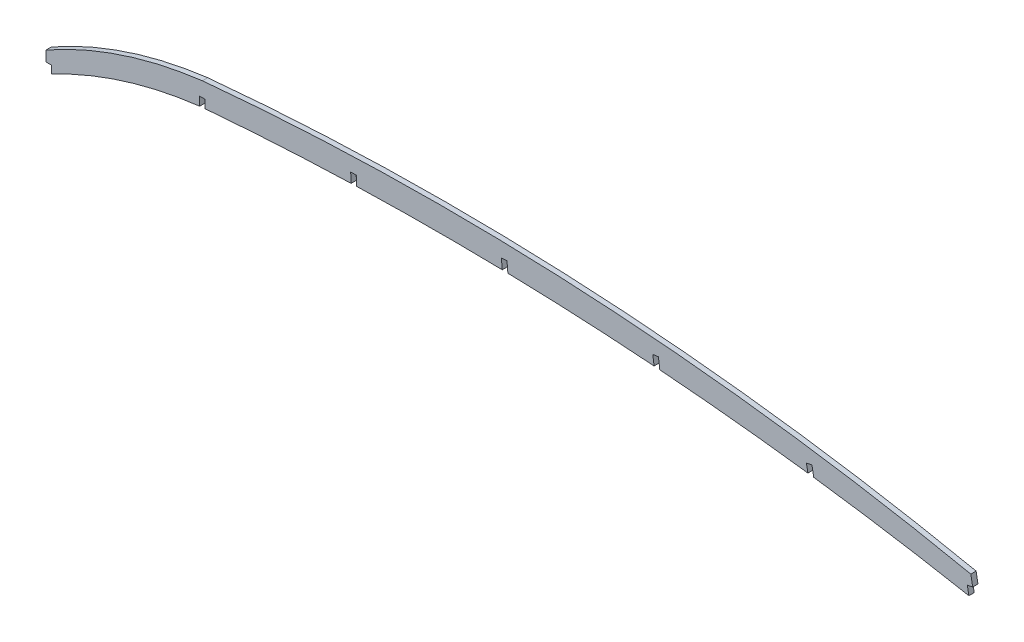
ISO-10303-21;
HEADER;
FILE_DESCRIPTION(('STEP AP214'),'2;1');
FILE_NAME('part.step','',(''),(''),'','','');
FILE_SCHEMA(('AUTOMOTIVE_DESIGN { 1 0 10303 214 1 1 1 1 }'));
ENDSEC;
DATA;
#1=APPLICATION_CONTEXT('core data for automotive mechanical design processes');
#2=APPLICATION_PROTOCOL_DEFINITION('international standard','automotive_design',2000,#1);
#3=PRODUCT_CONTEXT('',#1,'mechanical');
#4=PRODUCT('Part','Part','',(#3));
#5=PRODUCT_RELATED_PRODUCT_CATEGORY('part','',(#4));
#6=PRODUCT_DEFINITION_FORMATION('','',#4);
#7=PRODUCT_DEFINITION_CONTEXT('part definition',#1,'design');
#8=PRODUCT_DEFINITION('design','',#6,#7);
#9=PRODUCT_DEFINITION_SHAPE('','',#8);
#10=(LENGTH_UNIT() NAMED_UNIT(*) SI_UNIT(.MILLI.,.METRE.));
#11=(NAMED_UNIT(*) PLANE_ANGLE_UNIT() SI_UNIT($,.RADIAN.));
#12=(NAMED_UNIT(*) SI_UNIT($,.STERADIAN.) SOLID_ANGLE_UNIT());
#13=UNCERTAINTY_MEASURE_WITH_UNIT(LENGTH_MEASURE(1.E-05),#10,'distance_accuracy_value','');
#14=(GEOMETRIC_REPRESENTATION_CONTEXT(3) GLOBAL_UNCERTAINTY_ASSIGNED_CONTEXT((#13)) GLOBAL_UNIT_ASSIGNED_CONTEXT((#10,
#11,#12)) REPRESENTATION_CONTEXT('',''));
#15=CARTESIAN_POINT('',(0.,0.,0.));
#16=DIRECTION('',(0.,0.,1.));
#17=DIRECTION('',(1.,0.,0.));
#18=AXIS2_PLACEMENT_3D('',#15,#16,#17);
#19=CARTESIAN_POINT('',(7.23067605790107E-13,0.,-3.175));
#20=DIRECTION('',(-1.,0.,0.));
#21=DIRECTION('',(0.,-1.,0.));
#22=AXIS2_PLACEMENT_3D('',#19,#20,#21);
#23=PLANE('',#22);
#24=DIRECTION('',(0.,-1.,0.));
#25=VECTOR('',#24,1.);
#26=CARTESIAN_POINT('',(7.23067605790107E-13,0.,-3.175));
#27=LINE('',#26,#25);
#28=CARTESIAN_POINT('',(0.,106.68,-3.175));
#29=VERTEX_POINT('',#28);
#30=CARTESIAN_POINT('',(0.,100.457,-3.175));
#31=VERTEX_POINT('',#30);
#32=EDGE_CURVE('E280',#29,#31,#27,.T.);
#33=ORIENTED_EDGE('',*,*,#32,.T.);
#34=DIRECTION('',(0.,0.,1.));
#35=VECTOR('',#34,1.);
#36=CARTESIAN_POINT('',(0.,100.457,-3.175));
#37=LINE('',#36,#35);
#38=CARTESIAN_POINT('',(0.,100.457,0.));
#39=VERTEX_POINT('',#38);
#40=EDGE_CURVE('E285',#31,#39,#37,.T.);
#41=ORIENTED_EDGE('',*,*,#40,.T.);
#42=DIRECTION('',(0.,-1.,0.));
#43=VECTOR('',#42,1.);
#44=CARTESIAN_POINT('',(7.23067605790107E-13,0.,0.));
#45=LINE('',#44,#43);
#46=CARTESIAN_POINT('',(0.,106.68,0.));
#47=VERTEX_POINT('',#46);
#48=EDGE_CURVE('E260',#47,#39,#45,.T.);
#49=ORIENTED_EDGE('',*,*,#48,.F.);
#50=DIRECTION('',(0.,0.,1.));
#51=VECTOR('',#50,1.);
#52=CARTESIAN_POINT('',(0.,106.68,-3.175));
#53=LINE('',#52,#51);
#54=EDGE_CURVE('E11',#29,#47,#53,.T.);
#55=ORIENTED_EDGE('',*,*,#54,.F.);
#56=EDGE_LOOP('',(#33,#41,#49,#55));
#57=FACE_BOUND('',#56,.T.);
#58=ADVANCED_FACE('F39',(#57),#23,.T.);
#59=CARTESIAN_POINT('',(557.491562532306,101.659512414379,-3.175));
#60=DIRECTION('',(-0.983777409779827,-0.179393444715503,0.));
#61=DIRECTION('',(0.179393444715503,-0.983777409779827,0.));
#62=AXIS2_PLACEMENT_3D('',#59,#60,#61);
#63=PLANE('',#62);
#64=DIRECTION('',(0.,0.,1.));
#65=VECTOR('',#64,1.);
#66=CARTESIAN_POINT('',(556.764166066413,105.6484887799,-3.175));
#67=LINE('',#66,#65);
#68=CARTESIAN_POINT('',(556.764166066413,105.6484887799,-3.175));
#69=VERTEX_POINT('',#68);
#70=CARTESIAN_POINT('',(556.764166066413,105.6484887799,0.));
#71=VERTEX_POINT('',#70);
#72=EDGE_CURVE('E323',#69,#71,#67,.T.);
#73=ORIENTED_EDGE('',*,*,#72,.F.);
#74=DIRECTION('',(0.179393444715503,-0.983777409779827,0.));
#75=VECTOR('',#74,1.);
#76=CARTESIAN_POINT('',(557.491562532306,101.659512414379,-3.175));
#77=LINE('',#76,#75);
#78=CARTESIAN_POINT('',(555.638244478769,111.822940833397,-3.175));
#79=VERTEX_POINT('',#78);
#80=EDGE_CURVE('E273',#79,#69,#77,.T.);
#81=ORIENTED_EDGE('',*,*,#80,.F.);
#82=DIRECTION('',(0.,0.,1.));
#83=VECTOR('',#82,1.);
#84=CARTESIAN_POINT('',(555.638244478769,111.822940833397,-3.175));
#85=LINE('',#84,#83);
#86=CARTESIAN_POINT('',(555.638244478769,111.822940833397,0.));
#87=VERTEX_POINT('',#86);
#88=EDGE_CURVE('E43',#79,#87,#85,.T.);
#89=ORIENTED_EDGE('',*,*,#88,.T.);
#90=DIRECTION('',(0.179393444715503,-0.983777409779827,0.));
#91=VECTOR('',#90,1.);
#92=CARTESIAN_POINT('',(557.491562532306,101.659512414379,0.));
#93=LINE('',#92,#91);
#94=EDGE_CURVE('E290',#87,#71,#93,.T.);
#95=ORIENTED_EDGE('',*,*,#94,.T.);
#96=EDGE_LOOP('',(#73,#81,#89,#95));
#97=FACE_BOUND('',#96,.T.);
#98=ADVANCED_FACE('F306',(#97),#63,.F.);
#99=CARTESIAN_POINT('',(236.848565858002,-1577.85111526632,-3.175));
#100=DIRECTION('',(0.,0.,1.));
#101=DIRECTION('',(1.,0.,0.));
#102=AXIS2_PLACEMENT_3D('',#99,#100,#101);
#103=CYLINDRICAL_SURFACE('',#102,1707.63280925276);
#104=CARTESIAN_POINT('',(236.848565858002,-1577.85111526632,0.));
#105=DIRECTION('',(0.,0.,1.));
#106=DIRECTION('',(1.,0.,0.));
#107=AXIS2_PLACEMENT_3D('',#104,#105,#106);
#108=CIRCLE('',#107,1707.63280925276);
#109=CARTESIAN_POINT('',(95.6691,123.93564271968,0.));
#110=VERTEX_POINT('',#109);
#111=CARTESIAN_POINT('',(183.294622404811,128.941721130957,0.));
#112=VERTEX_POINT('',#111);
#113=EDGE_CURVE('E289',#110,#112,#108,.F.);
#114=ORIENTED_EDGE('',*,*,#113,.F.);
#115=DIRECTION('',(0.,0.,1.));
#116=VECTOR('',#115,1.);
#117=CARTESIAN_POINT('',(95.6691,123.93564271968,-3.175));
#118=LINE('',#117,#116);
#119=CARTESIAN_POINT('',(95.6691,123.93564271968,-3.175));
#120=VERTEX_POINT('',#119);
#121=EDGE_CURVE('E437',#120,#110,#118,.T.);
#122=ORIENTED_EDGE('',*,*,#121,.F.);
#123=CARTESIAN_POINT('',(236.848565858002,-1577.85111526632,-3.175));
#124=DIRECTION('',(0.,0.,1.));
#125=DIRECTION('',(1.,0.,0.));
#126=AXIS2_PLACEMENT_3D('',#123,#124,#125);
#127=CIRCLE('',#126,1707.63280925276);
#128=CARTESIAN_POINT('',(183.294622404811,128.941721130957,-3.175));
#129=VERTEX_POINT('',#128);
#130=EDGE_CURVE('E265',#120,#129,#127,.F.);
#131=ORIENTED_EDGE('',*,*,#130,.T.);
#132=DIRECTION('',(0.,0.,1.));
#133=VECTOR('',#132,1.);
#134=CARTESIAN_POINT('',(183.294622404811,128.941721130957,-3.175));
#135=LINE('',#134,#133);
#136=EDGE_CURVE('E414',#129,#112,#135,.T.);
#137=ORIENTED_EDGE('',*,*,#136,.T.);
#138=EDGE_LOOP('',(#114,#122,#131,#137));
#139=FACE_BOUND('',#138,.T.);
#140=ADVANCED_FACE('F482',(#139),#103,.F.);
#141=CARTESIAN_POINT('',(186.671482616281,129.044333070749,0.));
#142=VERTEX_POINT('',#141);
#143=CARTESIAN_POINT('',(274.098105392822,129.375373235102,0.));
#144=VERTEX_POINT('',#143);
#145=EDGE_CURVE('E825',#142,#144,#108,.F.);
#146=ORIENTED_EDGE('',*,*,#145,.F.);
#147=DIRECTION('',(0.,0.,1.));
#148=VECTOR('',#147,1.);
#149=CARTESIAN_POINT('',(186.671482616281,129.044333070749,-3.175));
#150=LINE('',#149,#148);
#151=CARTESIAN_POINT('',(186.671482616281,129.044333070749,-3.175));
#152=VERTEX_POINT('',#151);
#153=EDGE_CURVE('E417',#152,#142,#150,.T.);
#154=ORIENTED_EDGE('',*,*,#153,.F.);
#155=CARTESIAN_POINT('',(274.098105392822,129.375373235102,-3.175));
#156=VERTEX_POINT('',#155);
#157=EDGE_CURVE('E808',#152,#156,#127,.F.);
#158=ORIENTED_EDGE('',*,*,#157,.T.);
#159=DIRECTION('',(0.,0.,1.));
#160=VECTOR('',#159,1.);
#161=CARTESIAN_POINT('',(274.098105392822,129.375373235102,-3.175));
#162=LINE('',#161,#160);
#163=EDGE_CURVE('E391',#156,#144,#162,.T.);
#164=ORIENTED_EDGE('',*,*,#163,.T.);
#165=EDGE_LOOP('',(#146,#154,#158,#164));
#166=FACE_BOUND('',#165,.T.);
#167=ADVANCED_FACE('F706',(#166),#103,.F.);
#168=CARTESIAN_POINT('',(277.495469966465,129.29786488241,0.));
#169=VERTEX_POINT('',#168);
#170=CARTESIAN_POINT('',(365.330558587539,124.941352646519,0.));
#171=VERTEX_POINT('',#170);
#172=EDGE_CURVE('E827',#169,#171,#108,.F.);
#173=ORIENTED_EDGE('',*,*,#172,.F.);
#174=DIRECTION('',(0.,0.,1.));
#175=VECTOR('',#174,1.);
#176=CARTESIAN_POINT('',(277.495469966465,129.29786488241,-3.175));
#177=LINE('',#176,#175);
#178=CARTESIAN_POINT('',(277.495469966465,129.29786488241,-3.175));
#179=VERTEX_POINT('',#178);
#180=EDGE_CURVE('E394',#179,#169,#177,.T.);
#181=ORIENTED_EDGE('',*,*,#180,.F.);
#182=CARTESIAN_POINT('',(365.330558587539,124.941352646519,-3.175));
#183=VERTEX_POINT('',#182);
#184=EDGE_CURVE('E806',#179,#183,#127,.F.);
#185=ORIENTED_EDGE('',*,*,#184,.T.);
#186=DIRECTION('',(0.,0.,1.));
#187=VECTOR('',#186,1.);
#188=CARTESIAN_POINT('',(365.330558587539,124.941352646519,-3.175));
#189=LINE('',#188,#187);
#190=EDGE_CURVE('E366',#183,#171,#189,.T.);
#191=ORIENTED_EDGE('',*,*,#190,.T.);
#192=EDGE_LOOP('',(#173,#181,#185,#191));
#193=FACE_BOUND('',#192,.T.);
#194=ADVANCED_FACE('F716',(#193),#103,.F.);
#195=CARTESIAN_POINT('',(368.77346378483,124.678071720924,0.));
#196=VERTEX_POINT('',#195);
#197=CARTESIAN_POINT('',(457.732770478867,115.435623412472,0.));
#198=VERTEX_POINT('',#197);
#199=EDGE_CURVE('E288',#196,#198,#108,.F.);
#200=ORIENTED_EDGE('',*,*,#199,.F.);
#201=DIRECTION('',(0.,0.,1.));
#202=VECTOR('',#201,1.);
#203=CARTESIAN_POINT('',(368.77346378483,124.678071720924,-3.175));
#204=LINE('',#203,#202);
#205=CARTESIAN_POINT('',(368.77346378483,124.678071720924,-3.175));
#206=VERTEX_POINT('',#205);
#207=EDGE_CURVE('E369',#206,#196,#204,.T.);
#208=ORIENTED_EDGE('',*,*,#207,.F.);
#209=CARTESIAN_POINT('',(457.732770478867,115.435623412472,-3.175));
#210=VERTEX_POINT('',#209);
#211=EDGE_CURVE('E263',#206,#210,#127,.F.);
#212=ORIENTED_EDGE('',*,*,#211,.T.);
#213=DIRECTION('',(0.,0.,1.));
#214=VECTOR('',#213,1.);
#215=CARTESIAN_POINT('',(457.732770478867,115.435623412472,-3.175));
#216=LINE('',#215,#214);
#217=EDGE_CURVE('E341',#210,#198,#216,.T.);
#218=ORIENTED_EDGE('',*,*,#217,.T.);
#219=EDGE_LOOP('',(#200,#208,#212,#218));
#220=FACE_BOUND('',#219,.T.);
#221=ADVANCED_FACE('F726',(#220),#103,.F.);
#222=CARTESIAN_POINT('',(461.251045548048,114.972956616346,0.));
#223=VERTEX_POINT('',#222);
#224=CARTESIAN_POINT('',(554.466577904352,99.9833848141185,0.));
#225=VERTEX_POINT('',#224);
#226=EDGE_CURVE('E284',#223,#225,#108,.F.);
#227=ORIENTED_EDGE('',*,*,#226,.F.);
#228=DIRECTION('',(0.,0.,1.));
#229=VECTOR('',#228,1.);
#230=CARTESIAN_POINT('',(461.251045548048,114.972956616346,-3.175));
#231=LINE('',#230,#229);
#232=CARTESIAN_POINT('',(461.251045548048,114.972956616346,-3.175));
#233=VERTEX_POINT('',#232);
#234=EDGE_CURVE('E344',#233,#223,#231,.T.);
#235=ORIENTED_EDGE('',*,*,#234,.F.);
#236=CARTESIAN_POINT('',(554.466577904352,99.9833848141185,-3.175));
#237=VERTEX_POINT('',#236);
#238=EDGE_CURVE('E259',#233,#237,#127,.F.);
#239=ORIENTED_EDGE('',*,*,#238,.T.);
#240=DIRECTION('',(0.,0.,1.));
#241=VECTOR('',#240,1.);
#242=CARTESIAN_POINT('',(554.466577904352,99.9833848141185,-3.175));
#243=LINE('',#242,#241);
#244=EDGE_CURVE('E325',#237,#225,#243,.T.);
#245=ORIENTED_EDGE('',*,*,#244,.T.);
#246=EDGE_LOOP('',(#227,#235,#239,#245));
#247=FACE_BOUND('',#246,.T.);
#248=ADVANCED_FACE('F487',(#247),#103,.F.);
#249=CARTESIAN_POINT('',(0.,0.,-3.175));
#250=DIRECTION('',(0.,0.,1.));
#251=DIRECTION('',(1.,0.,0.));
#252=AXIS2_PLACEMENT_3D('',#249,#250,#251);
#253=PLANE('',#252);
#254=DIRECTION('',(1.,0.,0.));
#255=VECTOR('',#254,1.);
#256=CARTESIAN_POINT('',(0.,100.457,-3.175));
#257=LINE('',#256,#255);
#258=CARTESIAN_POINT('',(3.3528,100.457,-3.175));
#259=VERTEX_POINT('',#258);
#260=EDGE_CURVE('E243',#31,#259,#257,.T.);
#261=ORIENTED_EDGE('',*,*,#260,.F.);
#262=ORIENTED_EDGE('',*,*,#32,.F.);
#263=CARTESIAN_POINT('',(125.005388450822,-114.430046941018,-3.175));
#264=DIRECTION('',(0.,0.,1.));
#265=DIRECTION('',(1.,0.,0.));
#266=AXIS2_PLACEMENT_3D('',#263,#264,#265);
#267=CIRCLE('',#266,254.);
#268=CARTESIAN_POINT('',(93.9799999999999,137.668,-3.175));
#269=VERTEX_POINT('',#268);
#270=EDGE_CURVE('E278',#29,#269,#267,.F.);
#271=ORIENTED_EDGE('',*,*,#270,.T.);
#272=CARTESIAN_POINT('',(239.516480687623,-1398.7972273158,-3.175));
#273=DIRECTION('',(0.,0.,1.));
#274=DIRECTION('',(1.,0.,0.));
#275=AXIS2_PLACEMENT_3D('',#272,#273,#274);
#276=CIRCLE('',#275,1543.34256144303);
#277=EDGE_CURVE('E276',#269,#79,#276,.F.);
#278=ORIENTED_EDGE('',*,*,#277,.T.);
#279=ORIENTED_EDGE('',*,*,#80,.T.);
#280=DIRECTION('',(0.983777385928307,0.179393575515032,0.));
#281=VECTOR('',#280,1.);
#282=CARTESIAN_POINT('',(-0.727383479957661,3.98890214672276,-3.175));
#283=LINE('',#282,#281);
#284=CARTESIAN_POINT('',(553.540722527769,105.060688053699,-3.175));
#285=VERTEX_POINT('',#284);
#286=EDGE_CURVE('E317',#285,#69,#283,.T.);
#287=ORIENTED_EDGE('',*,*,#286,.F.);
#288=DIRECTION('',(0.179393575515035,-0.983777385928306,0.));
#289=VECTOR('',#288,1.);
#290=CARTESIAN_POINT('',(554.268106007726,101.071785906978,-3.175));
#291=LINE('',#290,#289);
#292=EDGE_CURVE('E320',#285,#237,#291,.T.);
#293=ORIENTED_EDGE('',*,*,#292,.T.);
#294=ORIENTED_EDGE('',*,*,#238,.F.);
#295=DIRECTION('',(0.179393575249242,-0.983777385976774,0.));
#296=VECTOR('',#295,1.);
#297=CARTESIAN_POINT('',(466.697850787917,85.1031922540635,-3.175));
#298=LINE('',#297,#296);
#299=CARTESIAN_POINT('',(460.178373044082,120.855391093135,-3.175));
#300=VERTEX_POINT('',#299);
#301=EDGE_CURVE('E349',#300,#233,#298,.T.);
#302=ORIENTED_EDGE('',*,*,#301,.F.);
#303=DIRECTION('',(0.983777385976774,0.17939357524924,0.));
#304=VECTOR('',#303,1.);
#305=CARTESIAN_POINT('',(-6.51947774383423,35.7521988390729,-3.175));
#306=LINE('',#305,#304);
#307=CARTESIAN_POINT('',(456.854976278776,120.249363717228,-3.175));
#308=VERTEX_POINT('',#307);
#309=EDGE_CURVE('E357',#308,#300,#306,.T.);
#310=ORIENTED_EDGE('',*,*,#309,.F.);
#311=DIRECTION('',(0.179393575249242,-0.983777385976774,0.));
#312=VECTOR('',#311,1.);
#313=CARTESIAN_POINT('',(463.37445402261,84.4971648781566,-3.175));
#314=LINE('',#313,#312);
#315=EDGE_CURVE('E339',#308,#210,#314,.T.);
#316=ORIENTED_EDGE('',*,*,#315,.T.);
#317=ORIENTED_EDGE('',*,*,#211,.F.);
#318=DIRECTION('',(0.131758387385287,-0.991281860700391,0.));
#319=VECTOR('',#318,1.);
#320=CARTESIAN_POINT('',(378.655621379288,50.329836573483,-3.175));
#321=LINE('',#320,#319);
#322=CARTESIAN_POINT('',(367.926681812887,131.048820675984,-3.175));
#323=VERTEX_POINT('',#322);
#324=EDGE_CURVE('E374',#323,#206,#321,.T.);
#325=ORIENTED_EDGE('',*,*,#324,.F.);
#326=DIRECTION('',(0.99128186070039,0.131758387385291,0.));
#327=VECTOR('',#326,1.);
#328=CARTESIAN_POINT('',(-10.7289395664012,80.7189841024994,-3.175));
#329=LINE('',#328,#327);
#330=CARTESIAN_POINT('',(364.577933431069,130.603714491719,-3.175));
#331=VERTEX_POINT('',#330);
#332=EDGE_CURVE('E382',#331,#323,#329,.T.);
#333=ORIENTED_EDGE('',*,*,#332,.F.);
#334=DIRECTION('',(0.131758387385292,-0.99128186070039,0.));
#335=VECTOR('',#334,1.);
#336=CARTESIAN_POINT('',(375.30687299747,49.8847303892201,-3.175));
#337=LINE('',#336,#335);
#338=EDGE_CURVE('E364',#331,#183,#337,.T.);
#339=ORIENTED_EDGE('',*,*,#338,.T.);
#340=ORIENTED_EDGE('',*,*,#184,.F.);
#341=DIRECTION('',(0.0857626231153062,-0.996315598832208,0.));
#342=VECTOR('',#341,1.);
#343=CARTESIAN_POINT('',(286.502495658872,24.6620705182039,-3.175));
#344=LINE('',#343,#342);
#345=CARTESIAN_POINT('',(276.956583497475,135.558179405811,-3.175));
#346=VERTEX_POINT('',#345);
#347=EDGE_CURVE('E398',#346,#179,#344,.T.);
#348=ORIENTED_EDGE('',*,*,#347,.F.);
#349=DIRECTION('',(0.996315598832208,0.0857626231153069,0.));
#350=VECTOR('',#349,1.);
#351=CARTESIAN_POINT('',(-9.54591216139695,110.896108887607,-3.175));
#352=LINE('',#351,#350);
#353=CARTESIAN_POINT('',(273.5908301415,135.268456112403,-3.175));
#354=VERTEX_POINT('',#353);
#355=EDGE_CURVE('E406',#354,#346,#352,.T.);
#356=ORIENTED_EDGE('',*,*,#355,.F.);
#357=DIRECTION('',(0.0857626231153062,-0.996315598832208,0.));
#358=VECTOR('',#357,1.);
#359=CARTESIAN_POINT('',(283.136742302897,24.3723472247958,-3.175));
#360=LINE('',#359,#358);
#361=EDGE_CURVE('E389',#354,#156,#360,.T.);
#362=ORIENTED_EDGE('',*,*,#361,.T.);
#363=ORIENTED_EDGE('',*,*,#157,.F.);
#364=DIRECTION('',(0.0417483675024306,-0.999128156850202,0.));
#365=VECTOR('',#364,1.);
#366=CARTESIAN_POINT('',(191.728821282335,8.01134993226182,-3.175));
#367=LINE('',#366,#365);
#368=CARTESIAN_POINT('',(186.429805754916,134.828179757341,-3.175));
#369=VERTEX_POINT('',#368);
#370=EDGE_CURVE('E421',#369,#152,#367,.T.);
#371=ORIENTED_EDGE('',*,*,#370,.F.);
#372=DIRECTION('',(0.999128156850202,0.0417483675024315,0.));
#373=VECTOR('',#372,1.);
#374=CARTESIAN_POINT('',(-5.29901552741899,126.816829825079,-3.175));
#375=LINE('',#374,#373);
#376=CARTESIAN_POINT('',(183.054551015444,134.687145422245,-3.175));
#377=VERTEX_POINT('',#376);
#378=EDGE_CURVE('E428',#377,#369,#375,.T.);
#379=ORIENTED_EDGE('',*,*,#378,.F.);
#380=DIRECTION('',(0.0417483675024306,-0.999128156850202,0.));
#381=VECTOR('',#380,1.);
#382=CARTESIAN_POINT('',(188.353566542863,7.87031559716512,-3.175));
#383=LINE('',#382,#381);
#384=EDGE_CURVE('E412',#377,#129,#383,.T.);
#385=ORIENTED_EDGE('',*,*,#384,.T.);
#386=ORIENTED_EDGE('',*,*,#130,.F.);
#387=DIRECTION('',(0.,-1.,0.));
#388=VECTOR('',#387,1.);
#389=CARTESIAN_POINT('',(95.6691,0.,-3.175));
#390=LINE('',#389,#388);
#391=CARTESIAN_POINT('',(95.6691,128.848746883729,-3.175));
#392=VERTEX_POINT('',#391);
#393=EDGE_CURVE('E442',#392,#120,#390,.T.);
#394=ORIENTED_EDGE('',*,*,#393,.F.);
#395=DIRECTION('',(1.,0.,0.));
#396=VECTOR('',#395,1.);
#397=CARTESIAN_POINT('',(0.,128.848746883729,-3.175));
#398=LINE('',#397,#396);
#399=CARTESIAN_POINT('',(92.2909,128.848746883729,-3.175));
#400=VERTEX_POINT('',#399);
#401=EDGE_CURVE('E448',#400,#392,#398,.T.);
#402=ORIENTED_EDGE('',*,*,#401,.F.);
#403=DIRECTION('',(0.,-1.,0.));
#404=VECTOR('',#403,1.);
#405=CARTESIAN_POINT('',(92.2909,0.,-3.175));
#406=LINE('',#405,#404);
#407=CARTESIAN_POINT('',(92.2909,123.599182896413,-3.175));
#408=VERTEX_POINT('',#407);
#409=EDGE_CURVE('E258',#400,#408,#406,.T.);
#410=ORIENTED_EDGE('',*,*,#409,.T.);
#411=CARTESIAN_POINT('',(122.337166720402,-128.617434034682,-3.175));
#412=DIRECTION('',(0.,0.,1.));
#413=DIRECTION('',(1.,0.,0.));
#414=AXIS2_PLACEMENT_3D('',#411,#412,#413);
#415=CIRCLE('',#414,254.);
#416=CARTESIAN_POINT('',(3.35279999999999,95.790053532344,-3.175));
#417=VERTEX_POINT('',#416);
#418=EDGE_CURVE('E250',#417,#408,#415,.F.);
#419=ORIENTED_EDGE('',*,*,#418,.F.);
#420=DIRECTION('',(0.,1.,0.));
#421=VECTOR('',#420,1.);
#422=CARTESIAN_POINT('',(3.35279999999999,0.,-3.175));
#423=LINE('',#422,#421);
#424=EDGE_CURVE('E233',#417,#259,#423,.T.);
#425=ORIENTED_EDGE('',*,*,#424,.T.);
#426=EDGE_LOOP('',(#261,#262,#271,#278,#279,#287,#293,#294,#302,#310,#316,#317,#325,#333,#339,
#340,#348,#356,#362,#363,#371,#379,#385,#386,#394,#402,#410,#419,#425));
#427=FACE_BOUND('',#426,.T.);
#428=ADVANCED_FACE('F255',(#427),#253,.F.);
#429=CARTESIAN_POINT('',(0.,0.,0.));
#430=DIRECTION('',(0.,0.,1.));
#431=DIRECTION('',(1.,0.,0.));
#432=AXIS2_PLACEMENT_3D('',#429,#430,#431);
#433=PLANE('',#432);
#434=ORIENTED_EDGE('',*,*,#48,.T.);
#435=DIRECTION('',(1.,0.,0.));
#436=VECTOR('',#435,1.);
#437=CARTESIAN_POINT('',(0.,100.457,0.));
#438=LINE('',#437,#436);
#439=CARTESIAN_POINT('',(3.3528,100.457,0.));
#440=VERTEX_POINT('',#439);
#441=EDGE_CURVE('E244',#39,#440,#438,.T.);
#442=ORIENTED_EDGE('',*,*,#441,.T.);
#443=DIRECTION('',(0.,1.,0.));
#444=VECTOR('',#443,1.);
#445=CARTESIAN_POINT('',(3.35279999999999,0.,0.));
#446=LINE('',#445,#444);
#447=CARTESIAN_POINT('',(3.35279999999999,95.790053532344,0.));
#448=VERTEX_POINT('',#447);
#449=EDGE_CURVE('E439',#448,#440,#446,.T.);
#450=ORIENTED_EDGE('',*,*,#449,.F.);
#451=CARTESIAN_POINT('',(122.337166720402,-128.617434034682,0.));
#452=DIRECTION('',(0.,0.,1.));
#453=DIRECTION('',(1.,0.,0.));
#454=AXIS2_PLACEMENT_3D('',#451,#452,#453);
#455=CIRCLE('',#454,254.);
#456=CARTESIAN_POINT('',(92.2909,123.599182896413,0.));
#457=VERTEX_POINT('',#456);
#458=EDGE_CURVE('E252',#448,#457,#455,.F.);
#459=ORIENTED_EDGE('',*,*,#458,.T.);
#460=DIRECTION('',(0.,-1.,0.));
#461=VECTOR('',#460,1.);
#462=CARTESIAN_POINT('',(92.2909,0.,0.));
#463=LINE('',#462,#461);
#464=CARTESIAN_POINT('',(92.2909,128.848746883729,0.));
#465=VERTEX_POINT('',#464);
#466=EDGE_CURVE('E440',#465,#457,#463,.T.);
#467=ORIENTED_EDGE('',*,*,#466,.F.);
#468=DIRECTION('',(1.,0.,0.));
#469=VECTOR('',#468,1.);
#470=CARTESIAN_POINT('',(0.,128.848746883729,0.));
#471=LINE('',#470,#469);
#472=CARTESIAN_POINT('',(95.6691,128.848746883729,0.));
#473=VERTEX_POINT('',#472);
#474=EDGE_CURVE('E443',#465,#473,#471,.T.);
#475=ORIENTED_EDGE('',*,*,#474,.T.);
#476=DIRECTION('',(0.,-1.,0.));
#477=VECTOR('',#476,1.);
#478=CARTESIAN_POINT('',(95.6691,0.,0.));
#479=LINE('',#478,#477);
#480=EDGE_CURVE('E56',#473,#110,#479,.T.);
#481=ORIENTED_EDGE('',*,*,#480,.T.);
#482=ORIENTED_EDGE('',*,*,#113,.T.);
#483=DIRECTION('',(0.0417483675024306,-0.999128156850202,0.));
#484=VECTOR('',#483,1.);
#485=CARTESIAN_POINT('',(188.353566542863,7.87031559716512,0.));
#486=LINE('',#485,#484);
#487=CARTESIAN_POINT('',(183.054551015444,134.687145422245,0.));
#488=VERTEX_POINT('',#487);
#489=EDGE_CURVE('E419',#488,#112,#486,.T.);
#490=ORIENTED_EDGE('',*,*,#489,.F.);
#491=DIRECTION('',(0.999128156850202,0.0417483675024315,0.));
#492=VECTOR('',#491,1.);
#493=CARTESIAN_POINT('',(-5.29901552741899,126.816829825079,0.));
#494=LINE('',#493,#492);
#495=CARTESIAN_POINT('',(186.429805754916,134.828179757341,0.));
#496=VERTEX_POINT('',#495);
#497=EDGE_CURVE('E422',#488,#496,#494,.T.);
#498=ORIENTED_EDGE('',*,*,#497,.T.);
#499=DIRECTION('',(0.0417483675024306,-0.999128156850202,0.));
#500=VECTOR('',#499,1.);
#501=CARTESIAN_POINT('',(191.728821282335,8.01134993226182,0.));
#502=LINE('',#501,#500);
#503=EDGE_CURVE('E64',#496,#142,#502,.T.);
#504=ORIENTED_EDGE('',*,*,#503,.T.);
#505=ORIENTED_EDGE('',*,*,#145,.T.);
#506=DIRECTION('',(0.0857626231153062,-0.996315598832208,0.));
#507=VECTOR('',#506,1.);
#508=CARTESIAN_POINT('',(283.136742302897,24.3723472247958,0.));
#509=LINE('',#508,#507);
#510=CARTESIAN_POINT('',(273.5908301415,135.268456112403,0.));
#511=VERTEX_POINT('',#510);
#512=EDGE_CURVE('E396',#511,#144,#509,.T.);
#513=ORIENTED_EDGE('',*,*,#512,.F.);
#514=DIRECTION('',(0.996315598832208,0.0857626231153069,0.));
#515=VECTOR('',#514,1.);
#516=CARTESIAN_POINT('',(-9.54591216139695,110.896108887607,0.));
#517=LINE('',#516,#515);
#518=CARTESIAN_POINT('',(276.956583497475,135.558179405811,0.));
#519=VERTEX_POINT('',#518);
#520=EDGE_CURVE('E399',#511,#519,#517,.T.);
#521=ORIENTED_EDGE('',*,*,#520,.T.);
#522=DIRECTION('',(0.0857626231153062,-0.996315598832208,0.));
#523=VECTOR('',#522,1.);
#524=CARTESIAN_POINT('',(286.502495658872,24.6620705182039,0.));
#525=LINE('',#524,#523);
#526=EDGE_CURVE('E371',#519,#169,#525,.T.);
#527=ORIENTED_EDGE('',*,*,#526,.T.);
#528=ORIENTED_EDGE('',*,*,#172,.T.);
#529=DIRECTION('',(0.131758387385292,-0.99128186070039,0.));
#530=VECTOR('',#529,1.);
#531=CARTESIAN_POINT('',(375.30687299747,49.8847303892201,0.));
#532=LINE('',#531,#530);
#533=CARTESIAN_POINT('',(364.577933431069,130.603714491719,0.));
#534=VERTEX_POINT('',#533);
#535=EDGE_CURVE('E372',#534,#171,#532,.T.);
#536=ORIENTED_EDGE('',*,*,#535,.F.);
#537=DIRECTION('',(0.99128186070039,0.131758387385291,0.));
#538=VECTOR('',#537,1.);
#539=CARTESIAN_POINT('',(-10.7289395664012,80.7189841024994,0.));
#540=LINE('',#539,#538);
#541=CARTESIAN_POINT('',(367.926681812887,131.048820675984,0.));
#542=VERTEX_POINT('',#541);
#543=EDGE_CURVE('E375',#534,#542,#540,.T.);
#544=ORIENTED_EDGE('',*,*,#543,.T.);
#545=DIRECTION('',(0.131758387385287,-0.991281860700391,0.));
#546=VECTOR('',#545,1.);
#547=CARTESIAN_POINT('',(378.655621379288,50.329836573483,0.));
#548=LINE('',#547,#546);
#549=EDGE_CURVE('E346',#542,#196,#548,.T.);
#550=ORIENTED_EDGE('',*,*,#549,.T.);
#551=ORIENTED_EDGE('',*,*,#199,.T.);
#552=DIRECTION('',(0.179393575249242,-0.983777385976774,0.));
#553=VECTOR('',#552,1.);
#554=CARTESIAN_POINT('',(463.37445402261,84.4971648781566,0.));
#555=LINE('',#554,#553);
#556=CARTESIAN_POINT('',(456.854976278776,120.249363717228,0.));
#557=VERTEX_POINT('',#556);
#558=EDGE_CURVE('E347',#557,#198,#555,.T.);
#559=ORIENTED_EDGE('',*,*,#558,.F.);
#560=DIRECTION('',(0.983777385976774,0.17939357524924,0.));
#561=VECTOR('',#560,1.);
#562=CARTESIAN_POINT('',(-6.51947774383423,35.7521988390729,0.));
#563=LINE('',#562,#561);
#564=CARTESIAN_POINT('',(460.178373044082,120.855391093135,0.));
#565=VERTEX_POINT('',#564);
#566=EDGE_CURVE('E350',#557,#565,#563,.T.);
#567=ORIENTED_EDGE('',*,*,#566,.T.);
#568=DIRECTION('',(0.179393575249242,-0.983777385976774,0.));
#569=VECTOR('',#568,1.);
#570=CARTESIAN_POINT('',(466.697850787917,85.1031922540635,0.));
#571=LINE('',#570,#569);
#572=EDGE_CURVE('E324',#565,#223,#571,.T.);
#573=ORIENTED_EDGE('',*,*,#572,.T.);
#574=ORIENTED_EDGE('',*,*,#226,.T.);
#575=DIRECTION('',(0.179393575515035,-0.983777385928306,0.));
#576=VECTOR('',#575,1.);
#577=CARTESIAN_POINT('',(554.268106007726,101.071785906978,0.));
#578=LINE('',#577,#576);
#579=CARTESIAN_POINT('',(553.540722527769,105.060688053699,0.));
#580=VERTEX_POINT('',#579);
#581=EDGE_CURVE('E313',#580,#225,#578,.T.);
#582=ORIENTED_EDGE('',*,*,#581,.F.);
#583=DIRECTION('',(0.983777385928307,0.179393575515032,0.));
#584=VECTOR('',#583,1.);
#585=CARTESIAN_POINT('',(-0.727383479957661,3.98890214672276,0.));
#586=LINE('',#585,#584);
#587=EDGE_CURVE('E312',#580,#71,#586,.T.);
#588=ORIENTED_EDGE('',*,*,#587,.T.);
#589=ORIENTED_EDGE('',*,*,#94,.F.);
#590=CARTESIAN_POINT('',(239.516480687623,-1398.7972273158,0.));
#591=DIRECTION('',(0.,0.,1.));
#592=DIRECTION('',(1.,0.,0.));
#593=AXIS2_PLACEMENT_3D('',#590,#591,#592);
#594=CIRCLE('',#593,1543.34256144303);
#595=CARTESIAN_POINT('',(93.9799999999999,137.668,0.));
#596=VERTEX_POINT('',#595);
#597=EDGE_CURVE('E293',#596,#87,#594,.F.);
#598=ORIENTED_EDGE('',*,*,#597,.F.);
#599=CARTESIAN_POINT('',(125.005388450822,-114.430046941018,0.));
#600=DIRECTION('',(0.,0.,1.));
#601=DIRECTION('',(1.,0.,0.));
#602=AXIS2_PLACEMENT_3D('',#599,#600,#601);
#603=CIRCLE('',#602,254.);
#604=EDGE_CURVE('E267',#47,#596,#603,.F.);
#605=ORIENTED_EDGE('',*,*,#604,.F.);
#606=EDGE_LOOP('',(#434,#442,#450,#459,#467,#475,#481,#482,#490,#498,#504,#505,#513,#521,#527,
#528,#536,#544,#550,#551,#559,#567,#573,#574,#582,#588,#589,#598,#605));
#607=FACE_BOUND('',#606,.T.);
#608=ADVANCED_FACE('F309',(#607),#433,.T.);
#609=CARTESIAN_POINT('',(122.337166720402,-128.617434034682,-3.175));
#610=DIRECTION('',(0.,0.,1.));
#611=DIRECTION('',(1.,0.,0.));
#612=AXIS2_PLACEMENT_3D('',#609,#610,#611);
#613=CYLINDRICAL_SURFACE('',#612,254.);
#614=DIRECTION('',(0.,0.,1.));
#615=VECTOR('',#614,1.);
#616=CARTESIAN_POINT('',(3.35279999999999,95.790053532344,-3.175));
#617=LINE('',#616,#615);
#618=EDGE_CURVE('E237',#417,#448,#617,.T.);
#619=ORIENTED_EDGE('',*,*,#618,.F.);
#620=ORIENTED_EDGE('',*,*,#418,.T.);
#621=DIRECTION('',(0.,0.,1.));
#622=VECTOR('',#621,1.);
#623=CARTESIAN_POINT('',(92.2909,123.599182896413,-3.175));
#624=LINE('',#623,#622);
#625=EDGE_CURVE('E435',#408,#457,#624,.T.);
#626=ORIENTED_EDGE('',*,*,#625,.T.);
#627=ORIENTED_EDGE('',*,*,#458,.F.);
#628=EDGE_LOOP('',(#619,#620,#626,#627));
#629=FACE_BOUND('',#628,.T.);
#630=ADVANCED_FACE('F41',(#629),#613,.F.);
#631=CARTESIAN_POINT('',(125.005388450822,-114.430046941018,-3.175));
#632=DIRECTION('',(0.,0.,1.));
#633=DIRECTION('',(1.,0.,0.));
#634=AXIS2_PLACEMENT_3D('',#631,#632,#633);
#635=CYLINDRICAL_SURFACE('',#634,254.);
#636=ORIENTED_EDGE('',*,*,#604,.T.);
#637=DIRECTION('',(0.,0.,1.));
#638=VECTOR('',#637,1.);
#639=CARTESIAN_POINT('',(93.9799999999999,137.668,-3.175));
#640=LINE('',#639,#638);
#641=EDGE_CURVE('E48',#269,#596,#640,.T.);
#642=ORIENTED_EDGE('',*,*,#641,.F.);
#643=ORIENTED_EDGE('',*,*,#270,.F.);
#644=ORIENTED_EDGE('',*,*,#54,.T.);
#645=EDGE_LOOP('',(#636,#642,#643,#644));
#646=FACE_BOUND('',#645,.T.);
#647=ADVANCED_FACE('F464',(#646),#635,.T.);
#648=CARTESIAN_POINT('',(239.516480687623,-1398.7972273158,-3.175));
#649=DIRECTION('',(0.,0.,1.));
#650=DIRECTION('',(1.,0.,0.));
#651=AXIS2_PLACEMENT_3D('',#648,#649,#650);
#652=CYLINDRICAL_SURFACE('',#651,1543.34256144303);
#653=ORIENTED_EDGE('',*,*,#597,.T.);
#654=ORIENTED_EDGE('',*,*,#88,.F.);
#655=ORIENTED_EDGE('',*,*,#277,.F.);
#656=ORIENTED_EDGE('',*,*,#641,.T.);
#657=EDGE_LOOP('',(#653,#654,#655,#656));
#658=FACE_BOUND('',#657,.T.);
#659=ADVANCED_FACE('F465',(#658),#652,.T.);
#660=CARTESIAN_POINT('',(-0.727383479957661,3.98890214672276,-3.175));
#661=DIRECTION('',(0.179393575515032,-0.983777385928307,0.));
#662=DIRECTION('',(0.983777385928307,0.179393575515032,0.));
#663=AXIS2_PLACEMENT_3D('',#660,#661,#662);
#664=PLANE('',#663);
#665=ORIENTED_EDGE('',*,*,#587,.F.);
#666=DIRECTION('',(0.,0.,1.));
#667=VECTOR('',#666,1.);
#668=CARTESIAN_POINT('',(553.540722527769,105.060688053699,-3.175));
#669=LINE('',#668,#667);
#670=EDGE_CURVE('E270',#285,#580,#669,.T.);
#671=ORIENTED_EDGE('',*,*,#670,.F.);
#672=ORIENTED_EDGE('',*,*,#286,.T.);
#673=ORIENTED_EDGE('',*,*,#72,.T.);
#674=EDGE_LOOP('',(#665,#671,#672,#673));
#675=FACE_BOUND('',#674,.T.);
#676=ADVANCED_FACE('F467',(#675),#664,.T.);
#677=CARTESIAN_POINT('',(554.268106007726,101.071785906978,-3.175));
#678=DIRECTION('',(-0.983777385928306,-0.179393575515035,0.));
#679=DIRECTION('',(0.179393575515035,-0.983777385928306,0.));
#680=AXIS2_PLACEMENT_3D('',#677,#678,#679);
#681=PLANE('',#680);
#682=ORIENTED_EDGE('',*,*,#581,.T.);
#683=ORIENTED_EDGE('',*,*,#244,.F.);
#684=ORIENTED_EDGE('',*,*,#292,.F.);
#685=ORIENTED_EDGE('',*,*,#670,.T.);
#686=EDGE_LOOP('',(#682,#683,#684,#685));
#687=FACE_BOUND('',#686,.T.);
#688=ADVANCED_FACE('F473',(#687),#681,.F.);
#689=CARTESIAN_POINT('',(466.697850787917,85.1031922540635,-3.175));
#690=DIRECTION('',(-0.983777385976774,-0.179393575249242,0.));
#691=DIRECTION('',(0.179393575249242,-0.983777385976774,0.));
#692=AXIS2_PLACEMENT_3D('',#689,#690,#691);
#693=PLANE('',#692);
#694=ORIENTED_EDGE('',*,*,#572,.F.);
#695=DIRECTION('',(0.,0.,1.));
#696=VECTOR('',#695,1.);
#697=CARTESIAN_POINT('',(460.178373044082,120.855391093135,-3.175));
#698=LINE('',#697,#696);
#699=EDGE_CURVE('E335',#300,#565,#698,.T.);
#700=ORIENTED_EDGE('',*,*,#699,.F.);
#701=ORIENTED_EDGE('',*,*,#301,.T.);
#702=ORIENTED_EDGE('',*,*,#234,.T.);
#703=EDGE_LOOP('',(#694,#700,#701,#702));
#704=FACE_BOUND('',#703,.T.);
#705=ADVANCED_FACE('F491',(#704),#693,.T.);
#706=CARTESIAN_POINT('',(463.37445402261,84.4971648781566,-3.175));
#707=DIRECTION('',(-0.983777385976774,-0.179393575249242,0.));
#708=DIRECTION('',(0.179393575249242,-0.983777385976774,0.));
#709=AXIS2_PLACEMENT_3D('',#706,#707,#708);
#710=PLANE('',#709);
#711=ORIENTED_EDGE('',*,*,#558,.T.);
#712=ORIENTED_EDGE('',*,*,#217,.F.);
#713=ORIENTED_EDGE('',*,*,#315,.F.);
#714=DIRECTION('',(0.,0.,1.));
#715=VECTOR('',#714,1.);
#716=CARTESIAN_POINT('',(456.854976278776,120.249363717228,-3.175));
#717=LINE('',#716,#715);
#718=EDGE_CURVE('E338',#308,#557,#717,.T.);
#719=ORIENTED_EDGE('',*,*,#718,.T.);
#720=EDGE_LOOP('',(#711,#712,#713,#719));
#721=FACE_BOUND('',#720,.T.);
#722=ADVANCED_FACE('F494',(#721),#710,.F.);
#723=CARTESIAN_POINT('',(-6.51947774383423,35.7521988390729,-3.175));
#724=DIRECTION('',(0.17939357524924,-0.983777385976774,0.));
#725=DIRECTION('',(0.983777385976774,0.17939357524924,0.));
#726=AXIS2_PLACEMENT_3D('',#723,#724,#725);
#727=PLANE('',#726);
#728=ORIENTED_EDGE('',*,*,#566,.F.);
#729=ORIENTED_EDGE('',*,*,#718,.F.);
#730=ORIENTED_EDGE('',*,*,#309,.T.);
#731=ORIENTED_EDGE('',*,*,#699,.T.);
#732=EDGE_LOOP('',(#728,#729,#730,#731));
#733=FACE_BOUND('',#732,.T.);
#734=ADVANCED_FACE('F496',(#733),#727,.T.);
#735=CARTESIAN_POINT('',(378.655621379288,50.329836573483,-3.175));
#736=DIRECTION('',(-0.991281860700391,-0.131758387385287,0.));
#737=DIRECTION('',(0.131758387385287,-0.991281860700391,0.));
#738=AXIS2_PLACEMENT_3D('',#735,#736,#737);
#739=PLANE('',#738);
#740=ORIENTED_EDGE('',*,*,#549,.F.);
#741=DIRECTION('',(0.,0.,1.));
#742=VECTOR('',#741,1.);
#743=CARTESIAN_POINT('',(367.926681812887,131.048820675984,-3.175));
#744=LINE('',#743,#742);
#745=EDGE_CURVE('E360',#323,#542,#744,.T.);
#746=ORIENTED_EDGE('',*,*,#745,.F.);
#747=ORIENTED_EDGE('',*,*,#324,.T.);
#748=ORIENTED_EDGE('',*,*,#207,.T.);
#749=EDGE_LOOP('',(#740,#746,#747,#748));
#750=FACE_BOUND('',#749,.T.);
#751=ADVANCED_FACE('F499',(#750),#739,.T.);
#752=CARTESIAN_POINT('',(375.30687299747,49.8847303892201,-3.175));
#753=DIRECTION('',(-0.99128186070039,-0.131758387385292,0.));
#754=DIRECTION('',(0.131758387385292,-0.99128186070039,0.));
#755=AXIS2_PLACEMENT_3D('',#752,#753,#754);
#756=PLANE('',#755);
#757=ORIENTED_EDGE('',*,*,#535,.T.);
#758=ORIENTED_EDGE('',*,*,#190,.F.);
#759=ORIENTED_EDGE('',*,*,#338,.F.);
#760=DIRECTION('',(0.,0.,1.));
#761=VECTOR('',#760,1.);
#762=CARTESIAN_POINT('',(364.577933431069,130.603714491719,-3.175));
#763=LINE('',#762,#761);
#764=EDGE_CURVE('E363',#331,#534,#763,.T.);
#765=ORIENTED_EDGE('',*,*,#764,.T.);
#766=EDGE_LOOP('',(#757,#758,#759,#765));
#767=FACE_BOUND('',#766,.T.);
#768=ADVANCED_FACE('F506',(#767),#756,.F.);
#769=CARTESIAN_POINT('',(-10.7289395664012,80.7189841024994,-3.175));
#770=DIRECTION('',(0.131758387385291,-0.99128186070039,0.));
#771=DIRECTION('',(0.99128186070039,0.131758387385291,0.));
#772=AXIS2_PLACEMENT_3D('',#769,#770,#771);
#773=PLANE('',#772);
#774=ORIENTED_EDGE('',*,*,#543,.F.);
#775=ORIENTED_EDGE('',*,*,#764,.F.);
#776=ORIENTED_EDGE('',*,*,#332,.T.);
#777=ORIENTED_EDGE('',*,*,#745,.T.);
#778=EDGE_LOOP('',(#774,#775,#776,#777));
#779=FACE_BOUND('',#778,.T.);
#780=ADVANCED_FACE('F508',(#779),#773,.T.);
#781=CARTESIAN_POINT('',(286.502495658872,24.6620705182039,-3.175));
#782=DIRECTION('',(-0.996315598832208,-0.0857626231153062,0.));
#783=DIRECTION('',(0.0857626231153062,-0.996315598832208,0.));
#784=AXIS2_PLACEMENT_3D('',#781,#782,#783);
#785=PLANE('',#784);
#786=ORIENTED_EDGE('',*,*,#526,.F.);
#787=DIRECTION('',(0.,0.,1.));
#788=VECTOR('',#787,1.);
#789=CARTESIAN_POINT('',(276.956583497475,135.558179405811,-3.175));
#790=LINE('',#789,#788);
#791=EDGE_CURVE('E385',#346,#519,#790,.T.);
#792=ORIENTED_EDGE('',*,*,#791,.F.);
#793=ORIENTED_EDGE('',*,*,#347,.T.);
#794=ORIENTED_EDGE('',*,*,#180,.T.);
#795=EDGE_LOOP('',(#786,#792,#793,#794));
#796=FACE_BOUND('',#795,.T.);
#797=ADVANCED_FACE('F511',(#796),#785,.T.);
#798=CARTESIAN_POINT('',(283.136742302897,24.3723472247958,-3.175));
#799=DIRECTION('',(-0.996315598832208,-0.0857626231153062,0.));
#800=DIRECTION('',(0.0857626231153062,-0.996315598832208,0.));
#801=AXIS2_PLACEMENT_3D('',#798,#799,#800);
#802=PLANE('',#801);
#803=ORIENTED_EDGE('',*,*,#512,.T.);
#804=ORIENTED_EDGE('',*,*,#163,.F.);
#805=ORIENTED_EDGE('',*,*,#361,.F.);
#806=DIRECTION('',(0.,0.,1.));
#807=VECTOR('',#806,1.);
#808=CARTESIAN_POINT('',(273.5908301415,135.268456112403,-3.175));
#809=LINE('',#808,#807);
#810=EDGE_CURVE('E388',#354,#511,#809,.T.);
#811=ORIENTED_EDGE('',*,*,#810,.T.);
#812=EDGE_LOOP('',(#803,#804,#805,#811));
#813=FACE_BOUND('',#812,.T.);
#814=ADVANCED_FACE('F518',(#813),#802,.F.);
#815=CARTESIAN_POINT('',(-9.54591216139695,110.896108887607,-3.175));
#816=DIRECTION('',(0.0857626231153069,-0.996315598832208,0.));
#817=DIRECTION('',(0.996315598832208,0.0857626231153069,0.));
#818=AXIS2_PLACEMENT_3D('',#815,#816,#817);
#819=PLANE('',#818);
#820=ORIENTED_EDGE('',*,*,#520,.F.);
#821=ORIENTED_EDGE('',*,*,#810,.F.);
#822=ORIENTED_EDGE('',*,*,#355,.T.);
#823=ORIENTED_EDGE('',*,*,#791,.T.);
#824=EDGE_LOOP('',(#820,#821,#822,#823));
#825=FACE_BOUND('',#824,.T.);
#826=ADVANCED_FACE('F520',(#825),#819,.T.);
#827=CARTESIAN_POINT('',(191.728821282335,8.01134993226182,-3.175));
#828=DIRECTION('',(-0.999128156850202,-0.0417483675024306,0.));
#829=DIRECTION('',(0.0417483675024306,-0.999128156850202,0.));
#830=AXIS2_PLACEMENT_3D('',#827,#828,#829);
#831=PLANE('',#830);
#832=ORIENTED_EDGE('',*,*,#503,.F.);
#833=DIRECTION('',(0.,0.,1.));
#834=VECTOR('',#833,1.);
#835=CARTESIAN_POINT('',(186.429805754916,134.828179757341,-3.175));
#836=LINE('',#835,#834);
#837=EDGE_CURVE('E409',#369,#496,#836,.T.);
#838=ORIENTED_EDGE('',*,*,#837,.F.);
#839=ORIENTED_EDGE('',*,*,#370,.T.);
#840=ORIENTED_EDGE('',*,*,#153,.T.);
#841=EDGE_LOOP('',(#832,#838,#839,#840));
#842=FACE_BOUND('',#841,.T.);
#843=ADVANCED_FACE('F523',(#842),#831,.T.);
#844=CARTESIAN_POINT('',(188.353566542863,7.87031559716512,-3.175));
#845=DIRECTION('',(-0.999128156850202,-0.0417483675024306,0.));
#846=DIRECTION('',(0.0417483675024306,-0.999128156850202,0.));
#847=AXIS2_PLACEMENT_3D('',#844,#845,#846);
#848=PLANE('',#847);
#849=ORIENTED_EDGE('',*,*,#489,.T.);
#850=ORIENTED_EDGE('',*,*,#136,.F.);
#851=ORIENTED_EDGE('',*,*,#384,.F.);
#852=DIRECTION('',(0.,0.,1.));
#853=VECTOR('',#852,1.);
#854=CARTESIAN_POINT('',(183.054551015444,134.687145422245,-3.175));
#855=LINE('',#854,#853);
#856=EDGE_CURVE('E411',#377,#488,#855,.T.);
#857=ORIENTED_EDGE('',*,*,#856,.T.);
#858=EDGE_LOOP('',(#849,#850,#851,#857));
#859=FACE_BOUND('',#858,.T.);
#860=ADVANCED_FACE('F530',(#859),#848,.F.);
#861=CARTESIAN_POINT('',(-5.29901552741899,126.816829825079,-3.175));
#862=DIRECTION('',(0.0417483675024315,-0.999128156850202,0.));
#863=DIRECTION('',(0.999128156850202,0.0417483675024315,0.));
#864=AXIS2_PLACEMENT_3D('',#861,#862,#863);
#865=PLANE('',#864);
#866=ORIENTED_EDGE('',*,*,#497,.F.);
#867=ORIENTED_EDGE('',*,*,#856,.F.);
#868=ORIENTED_EDGE('',*,*,#378,.T.);
#869=ORIENTED_EDGE('',*,*,#837,.T.);
#870=EDGE_LOOP('',(#866,#867,#868,#869));
#871=FACE_BOUND('',#870,.T.);
#872=ADVANCED_FACE('F531',(#871),#865,.T.);
#873=CARTESIAN_POINT('',(95.6691,0.,-3.175));
#874=DIRECTION('',(-1.,0.,0.));
#875=DIRECTION('',(0.,0.,1.));
#876=AXIS2_PLACEMENT_3D('',#873,#874,#875);
#877=PLANE('',#876);
#878=ORIENTED_EDGE('',*,*,#480,.F.);
#879=DIRECTION('',(0.,0.,1.));
#880=VECTOR('',#879,1.);
#881=CARTESIAN_POINT('',(95.6691,128.848746883729,-3.175));
#882=LINE('',#881,#880);
#883=EDGE_CURVE('E431',#392,#473,#882,.T.);
#884=ORIENTED_EDGE('',*,*,#883,.F.);
#885=ORIENTED_EDGE('',*,*,#393,.T.);
#886=ORIENTED_EDGE('',*,*,#121,.T.);
#887=EDGE_LOOP('',(#878,#884,#885,#886));
#888=FACE_BOUND('',#887,.T.);
#889=ADVANCED_FACE('F534',(#888),#877,.T.);
#890=CARTESIAN_POINT('',(92.2909,0.,-3.175));
#891=DIRECTION('',(-1.,0.,0.));
#892=DIRECTION('',(0.,0.,1.));
#893=AXIS2_PLACEMENT_3D('',#890,#891,#892);
#894=PLANE('',#893);
#895=ORIENTED_EDGE('',*,*,#466,.T.);
#896=ORIENTED_EDGE('',*,*,#625,.F.);
#897=ORIENTED_EDGE('',*,*,#409,.F.);
#898=DIRECTION('',(0.,0.,1.));
#899=VECTOR('',#898,1.);
#900=CARTESIAN_POINT('',(92.2909,128.848746883729,-3.175));
#901=LINE('',#900,#899);
#902=EDGE_CURVE('E433',#400,#465,#901,.T.);
#903=ORIENTED_EDGE('',*,*,#902,.T.);
#904=EDGE_LOOP('',(#895,#896,#897,#903));
#905=FACE_BOUND('',#904,.T.);
#906=ADVANCED_FACE('F541',(#905),#894,.F.);
#907=CARTESIAN_POINT('',(0.,128.848746883729,-3.175));
#908=DIRECTION('',(0.,-1.,0.));
#909=DIRECTION('',(0.,0.,-1.));
#910=AXIS2_PLACEMENT_3D('',#907,#908,#909);
#911=PLANE('',#910);
#912=ORIENTED_EDGE('',*,*,#474,.F.);
#913=ORIENTED_EDGE('',*,*,#902,.F.);
#914=ORIENTED_EDGE('',*,*,#401,.T.);
#915=ORIENTED_EDGE('',*,*,#883,.T.);
#916=EDGE_LOOP('',(#912,#913,#914,#915));
#917=FACE_BOUND('',#916,.T.);
#918=ADVANCED_FACE('F542',(#917),#911,.T.);
#919=CARTESIAN_POINT('',(0.,100.457,-3.175));
#920=DIRECTION('',(0.,-1.,0.));
#921=DIRECTION('',(0.,0.,-1.));
#922=AXIS2_PLACEMENT_3D('',#919,#920,#921);
#923=PLANE('',#922);
#924=ORIENTED_EDGE('',*,*,#441,.F.);
#925=ORIENTED_EDGE('',*,*,#40,.F.);
#926=ORIENTED_EDGE('',*,*,#260,.T.);
#927=DIRECTION('',(0.,0.,1.));
#928=VECTOR('',#927,1.);
#929=CARTESIAN_POINT('',(3.3528,100.457,-3.175));
#930=LINE('',#929,#928);
#931=EDGE_CURVE('E239',#259,#440,#930,.T.);
#932=ORIENTED_EDGE('',*,*,#931,.T.);
#933=EDGE_LOOP('',(#924,#925,#926,#932));
#934=FACE_BOUND('',#933,.T.);
#935=ADVANCED_FACE('F458',(#934),#923,.T.);
#936=CARTESIAN_POINT('',(3.35279999999999,0.,-3.175));
#937=DIRECTION('',(1.,0.,0.));
#938=DIRECTION('',(0.,1.,0.));
#939=AXIS2_PLACEMENT_3D('',#936,#937,#938);
#940=PLANE('',#939);
#941=ORIENTED_EDGE('',*,*,#449,.T.);
#942=ORIENTED_EDGE('',*,*,#931,.F.);
#943=ORIENTED_EDGE('',*,*,#424,.F.);
#944=ORIENTED_EDGE('',*,*,#618,.T.);
#945=EDGE_LOOP('',(#941,#942,#943,#944));
#946=FACE_BOUND('',#945,.T.);
#947=ADVANCED_FACE('F236',(#946),#940,.F.);
#948=CLOSED_SHELL('',(#58,#98,#140,#167,#194,#221,#248,#428,#608,#630,#647,#659,#676,#688,#705,
#722,#734,#751,#768,#780,#797,#814,#826,#843,#860,#872,#889,#906,#918,#935,#947));
#949=MANIFOLD_SOLID_BREP('B2',#948);
#950=ADVANCED_BREP_SHAPE_REPRESENTATION('',(#18,#949),#14);
#951=SHAPE_DEFINITION_REPRESENTATION(#9,#950);
ENDSEC;
END-ISO-10303-21;
